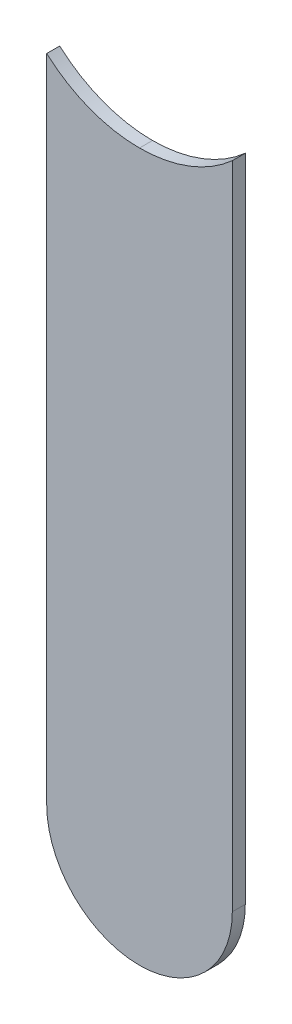
ISO-10303-21;
HEADER;
FILE_DESCRIPTION(('STEP AP214'),'2;1');
FILE_NAME('part.step','',(''),(''),'','','');
FILE_SCHEMA(('AUTOMOTIVE_DESIGN { 1 0 10303 214 1 1 1 1 }'));
ENDSEC;
DATA;
#1=APPLICATION_CONTEXT('core data for automotive mechanical design processes');
#2=APPLICATION_PROTOCOL_DEFINITION('international standard','automotive_design',2000,#1);
#3=PRODUCT_CONTEXT('',#1,'mechanical');
#4=PRODUCT('Part','Part','',(#3));
#5=PRODUCT_RELATED_PRODUCT_CATEGORY('part','',(#4));
#6=PRODUCT_DEFINITION_FORMATION('','',#4);
#7=PRODUCT_DEFINITION_CONTEXT('part definition',#1,'design');
#8=PRODUCT_DEFINITION('design','',#6,#7);
#9=PRODUCT_DEFINITION_SHAPE('','',#8);
#10=(LENGTH_UNIT() NAMED_UNIT(*) SI_UNIT(.MILLI.,.METRE.));
#11=(NAMED_UNIT(*) PLANE_ANGLE_UNIT() SI_UNIT($,.RADIAN.));
#12=(NAMED_UNIT(*) SI_UNIT($,.STERADIAN.) SOLID_ANGLE_UNIT());
#13=UNCERTAINTY_MEASURE_WITH_UNIT(LENGTH_MEASURE(1.E-05),#10,'distance_accuracy_value','');
#14=(GEOMETRIC_REPRESENTATION_CONTEXT(3) GLOBAL_UNCERTAINTY_ASSIGNED_CONTEXT((#13)) GLOBAL_UNIT_ASSIGNED_CONTEXT((#10,
#11,#12)) REPRESENTATION_CONTEXT('',''));
#15=CARTESIAN_POINT('',(0.,0.,0.));
#16=DIRECTION('',(0.,0.,1.));
#17=DIRECTION('',(1.,0.,0.));
#18=AXIS2_PLACEMENT_3D('',#15,#16,#17);
#19=CARTESIAN_POINT('',(160.02,-80.772,-0.045));
#20=DIRECTION('',(0.,0.,-1.));
#21=DIRECTION('',(0.,-1.,0.));
#22=AXIS2_PLACEMENT_3D('',#19,#20,#21);
#23=CYLINDRICAL_SURFACE('',#22,0.375);
#24=DIRECTION('',(0.,0.,1.));
#25=VECTOR('',#24,1.);
#26=CARTESIAN_POINT('',(160.02,-81.147,-0.045));
#27=LINE('',#26,#25);
#28=CARTESIAN_POINT('',(160.02,-81.147,-0.035));
#29=VERTEX_POINT('',#28);
#30=CARTESIAN_POINT('',(160.02,-81.147,0.));
#31=VERTEX_POINT('',#30);
#32=EDGE_CURVE('E132',#29,#31,#27,.T.);
#33=ORIENTED_EDGE('',*,*,#32,.F.);
#34=CARTESIAN_POINT('',(160.02,-80.772,-0.035));
#35=DIRECTION('',(0.,0.,-1.));
#36=DIRECTION('',(0.,-1.,0.));
#37=AXIS2_PLACEMENT_3D('',#34,#35,#36);
#38=CIRCLE('',#37,0.375);
#39=CARTESIAN_POINT('',(159.77,-81.05150849718,-0.035));
#40=VERTEX_POINT('',#39);
#41=EDGE_CURVE('E87',#29,#40,#38,.T.);
#42=ORIENTED_EDGE('',*,*,#41,.T.);
#43=DIRECTION('',(0.,0.,-1.));
#44=VECTOR('',#43,1.);
#45=CARTESIAN_POINT('',(159.77,-81.05150849718,-0.045));
#46=LINE('',#45,#44);
#47=CARTESIAN_POINT('',(159.77,-81.05150849718,0.));
#48=VERTEX_POINT('',#47);
#49=EDGE_CURVE('E11',#48,#40,#46,.T.);
#50=ORIENTED_EDGE('',*,*,#49,.F.);
#51=CARTESIAN_POINT('',(160.02,-80.772,0.));
#52=DIRECTION('',(0.,0.,-1.));
#53=DIRECTION('',(0.,-1.,0.));
#54=AXIS2_PLACEMENT_3D('',#51,#52,#53);
#55=CIRCLE('',#54,0.375);
#56=EDGE_CURVE('E117',#31,#48,#55,.T.);
#57=ORIENTED_EDGE('',*,*,#56,.F.);
#58=EDGE_LOOP('',(#33,#42,#50,#57));
#59=FACE_BOUND('',#58,.T.);
#60=ADVANCED_FACE('F17',(#59),#23,.F.);
#61=CARTESIAN_POINT('',(159.77,-80.772,-0.035));
#62=DIRECTION('',(1.,0.,0.));
#63=DIRECTION('',(0.,1.,0.));
#64=AXIS2_PLACEMENT_3D('',#61,#62,#63);
#65=PLANE('',#64);
#66=DIRECTION('',(0.,0.,1.));
#67=VECTOR('',#66,1.);
#68=CARTESIAN_POINT('',(159.77,-82.804,-0.035));
#69=LINE('',#68,#67);
#70=CARTESIAN_POINT('',(159.77,-82.804,-0.035));
#71=VERTEX_POINT('',#70);
#72=CARTESIAN_POINT('',(159.77,-82.804,0.));
#73=VERTEX_POINT('',#72);
#74=EDGE_CURVE('E26',#71,#73,#69,.T.);
#75=ORIENTED_EDGE('',*,*,#74,.T.);
#76=DIRECTION('',(0.,-1.,0.));
#77=VECTOR('',#76,1.);
#78=CARTESIAN_POINT('',(159.77,-80.772,0.));
#79=LINE('',#78,#77);
#80=EDGE_CURVE('E20',#48,#73,#79,.T.);
#81=ORIENTED_EDGE('',*,*,#80,.F.);
#82=ORIENTED_EDGE('',*,*,#49,.T.);
#83=DIRECTION('',(0.,-1.,0.));
#84=VECTOR('',#83,1.);
#85=CARTESIAN_POINT('',(159.77,-80.772,-0.035));
#86=LINE('',#85,#84);
#87=EDGE_CURVE('E102',#40,#71,#86,.T.);
#88=ORIENTED_EDGE('',*,*,#87,.T.);
#89=EDGE_LOOP('',(#75,#81,#82,#88));
#90=FACE_BOUND('',#89,.T.);
#91=ADVANCED_FACE('F144',(#90),#65,.F.);
#92=CARTESIAN_POINT('',(160.02,-82.804,-0.035));
#93=DIRECTION('',(0.,0.,-1.));
#94=DIRECTION('',(-1.,0.,0.));
#95=AXIS2_PLACEMENT_3D('',#92,#93,#94);
#96=CYLINDRICAL_SURFACE('',#95,0.25);
#97=CARTESIAN_POINT('',(160.02,-82.804,-0.035));
#98=DIRECTION('',(0.,0.,1.));
#99=DIRECTION('',(-1.,0.,0.));
#100=AXIS2_PLACEMENT_3D('',#97,#98,#99);
#101=CIRCLE('',#100,0.25);
#102=CARTESIAN_POINT('',(160.27,-82.804,-0.035));
#103=VERTEX_POINT('',#102);
#104=EDGE_CURVE('E92',#71,#103,#101,.T.);
#105=ORIENTED_EDGE('',*,*,#104,.T.);
#106=DIRECTION('',(0.,0.,1.));
#107=VECTOR('',#106,1.);
#108=CARTESIAN_POINT('',(160.27,-82.804,-0.035));
#109=LINE('',#108,#107);
#110=CARTESIAN_POINT('',(160.27,-82.804,0.));
#111=VERTEX_POINT('',#110);
#112=EDGE_CURVE('E100',#103,#111,#109,.T.);
#113=ORIENTED_EDGE('',*,*,#112,.T.);
#114=CARTESIAN_POINT('',(160.02,-82.804,0.));
#115=DIRECTION('',(0.,0.,1.));
#116=DIRECTION('',(-1.,0.,0.));
#117=AXIS2_PLACEMENT_3D('',#114,#115,#116);
#118=CIRCLE('',#117,0.25);
#119=EDGE_CURVE('E121',#73,#111,#118,.T.);
#120=ORIENTED_EDGE('',*,*,#119,.F.);
#121=ORIENTED_EDGE('',*,*,#74,.F.);
#122=EDGE_LOOP('',(#105,#113,#120,#121));
#123=FACE_BOUND('',#122,.T.);
#124=ADVANCED_FACE('F143',(#123),#96,.T.);
#125=CARTESIAN_POINT('',(160.27,-82.804,0.));
#126=DIRECTION('',(0.,0.,1.));
#127=DIRECTION('',(1.,0.,0.));
#128=AXIS2_PLACEMENT_3D('',#125,#126,#127);
#129=PLANE('',#128);
#130=ORIENTED_EDGE('',*,*,#119,.T.);
#131=DIRECTION('',(0.,1.,0.));
#132=VECTOR('',#131,1.);
#133=CARTESIAN_POINT('',(160.27,-82.804,0.));
#134=LINE('',#133,#132);
#135=CARTESIAN_POINT('',(160.27,-81.05150849717,0.));
#136=VERTEX_POINT('',#135);
#137=EDGE_CURVE('E109',#111,#136,#134,.T.);
#138=ORIENTED_EDGE('',*,*,#137,.T.);
#139=CARTESIAN_POINT('',(160.02,-80.772,0.));
#140=DIRECTION('',(0.,0.,-1.));
#141=DIRECTION('',(0.,-1.,0.));
#142=AXIS2_PLACEMENT_3D('',#139,#140,#141);
#143=CIRCLE('',#142,0.375);
#144=EDGE_CURVE('E106',#136,#31,#143,.T.);
#145=ORIENTED_EDGE('',*,*,#144,.T.);
#146=ORIENTED_EDGE('',*,*,#56,.T.);
#147=ORIENTED_EDGE('',*,*,#80,.T.);
#148=EDGE_LOOP('',(#130,#138,#145,#146,#147));
#149=FACE_BOUND('',#148,.T.);
#150=ADVANCED_FACE('F141',(#149),#129,.T.);
#151=CARTESIAN_POINT('',(160.02,-80.772,-0.045));
#152=DIRECTION('',(0.,0.,-1.));
#153=DIRECTION('',(0.,-1.,0.));
#154=AXIS2_PLACEMENT_3D('',#151,#152,#153);
#155=CYLINDRICAL_SURFACE('',#154,0.375);
#156=CARTESIAN_POINT('',(160.02,-80.772,-0.035));
#157=DIRECTION('',(0.,0.,-1.));
#158=DIRECTION('',(0.,-1.,0.));
#159=AXIS2_PLACEMENT_3D('',#156,#157,#158);
#160=CIRCLE('',#159,0.375);
#161=CARTESIAN_POINT('',(160.27,-81.05150849717,-0.035));
#162=VERTEX_POINT('',#161);
#163=EDGE_CURVE('E80',#162,#29,#160,.T.);
#164=ORIENTED_EDGE('',*,*,#163,.T.);
#165=ORIENTED_EDGE('',*,*,#32,.T.);
#166=ORIENTED_EDGE('',*,*,#144,.F.);
#167=DIRECTION('',(0.,0.,-1.));
#168=VECTOR('',#167,1.);
#169=CARTESIAN_POINT('',(160.27,-81.05150849718,-0.045));
#170=LINE('',#169,#168);
#171=EDGE_CURVE('E98',#136,#162,#170,.T.);
#172=ORIENTED_EDGE('',*,*,#171,.T.);
#173=EDGE_LOOP('',(#164,#165,#166,#172));
#174=FACE_BOUND('',#173,.T.);
#175=ADVANCED_FACE('F104',(#174),#155,.F.);
#176=CARTESIAN_POINT('',(160.27,-82.804,-0.035));
#177=DIRECTION('',(0.,0.,1.));
#178=DIRECTION('',(1.,0.,0.));
#179=AXIS2_PLACEMENT_3D('',#176,#177,#178);
#180=PLANE('',#179);
#181=ORIENTED_EDGE('',*,*,#87,.F.);
#182=ORIENTED_EDGE('',*,*,#41,.F.);
#183=ORIENTED_EDGE('',*,*,#163,.F.);
#184=DIRECTION('',(0.,1.,0.));
#185=VECTOR('',#184,1.);
#186=CARTESIAN_POINT('',(160.27,-82.804,-0.035));
#187=LINE('',#186,#185);
#188=EDGE_CURVE('E85',#103,#162,#187,.T.);
#189=ORIENTED_EDGE('',*,*,#188,.F.);
#190=ORIENTED_EDGE('',*,*,#104,.F.);
#191=EDGE_LOOP('',(#181,#182,#183,#189,#190));
#192=FACE_BOUND('',#191,.T.);
#193=ADVANCED_FACE('F83',(#192),#180,.F.);
#194=CARTESIAN_POINT('',(160.27,-82.804,-0.035));
#195=DIRECTION('',(-1.,0.,0.));
#196=DIRECTION('',(0.,0.,1.));
#197=AXIS2_PLACEMENT_3D('',#194,#195,#196);
#198=PLANE('',#197);
#199=ORIENTED_EDGE('',*,*,#171,.F.);
#200=ORIENTED_EDGE('',*,*,#137,.F.);
#201=ORIENTED_EDGE('',*,*,#112,.F.);
#202=ORIENTED_EDGE('',*,*,#188,.T.);
#203=EDGE_LOOP('',(#199,#200,#201,#202));
#204=FACE_BOUND('',#203,.T.);
#205=ADVANCED_FACE('F96',(#204),#198,.F.);
#206=CLOSED_SHELL('',(#60,#91,#124,#150,#175,#193,#205));
#207=MANIFOLD_SOLID_BREP('B1',#206);
#208=ADVANCED_BREP_SHAPE_REPRESENTATION('',(#18,#207),#14);
#209=SHAPE_DEFINITION_REPRESENTATION(#9,#208);
ENDSEC;
END-ISO-10303-21;
